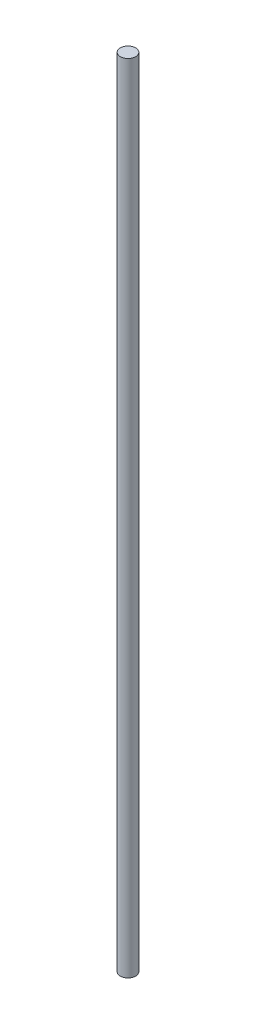
ISO-10303-21;
HEADER;
FILE_DESCRIPTION(('STEP AP214'),'2;1');
FILE_NAME('part.step','',(''),(''),'','','');
FILE_SCHEMA(('AUTOMOTIVE_DESIGN { 1 0 10303 214 1 1 1 1 }'));
ENDSEC;
DATA;
#1=APPLICATION_CONTEXT('core data for automotive mechanical design processes');
#2=APPLICATION_PROTOCOL_DEFINITION('international standard','automotive_design',2000,#1);
#3=PRODUCT_CONTEXT('',#1,'mechanical');
#4=PRODUCT('Part','Part','',(#3));
#5=PRODUCT_RELATED_PRODUCT_CATEGORY('part','',(#4));
#6=PRODUCT_DEFINITION_FORMATION('','',#4);
#7=PRODUCT_DEFINITION_CONTEXT('part definition',#1,'design');
#8=PRODUCT_DEFINITION('design','',#6,#7);
#9=PRODUCT_DEFINITION_SHAPE('','',#8);
#10=(LENGTH_UNIT() NAMED_UNIT(*) SI_UNIT(.MILLI.,.METRE.));
#11=(NAMED_UNIT(*) PLANE_ANGLE_UNIT() SI_UNIT($,.RADIAN.));
#12=(NAMED_UNIT(*) SI_UNIT($,.STERADIAN.) SOLID_ANGLE_UNIT());
#13=UNCERTAINTY_MEASURE_WITH_UNIT(LENGTH_MEASURE(1.E-05),#10,'distance_accuracy_value','');
#14=(GEOMETRIC_REPRESENTATION_CONTEXT(3) GLOBAL_UNCERTAINTY_ASSIGNED_CONTEXT((#13)) GLOBAL_UNIT_ASSIGNED_CONTEXT((#10,
#11,#12)) REPRESENTATION_CONTEXT('',''));
#15=CARTESIAN_POINT('',(0.,0.,0.));
#16=DIRECTION('',(0.,0.,1.));
#17=DIRECTION('',(1.,0.,0.));
#18=AXIS2_PLACEMENT_3D('',#15,#16,#17);
#19=CARTESIAN_POINT('',(0.,494.,0.));
#20=DIRECTION('',(0.,-1.,0.));
#21=DIRECTION('',(0.,0.,-1.));
#22=AXIS2_PLACEMENT_3D('',#19,#20,#21);
#23=CYLINDRICAL_SURFACE('',#22,4.75);
#24=CARTESIAN_POINT('',(0.,494.,0.));
#25=DIRECTION('',(0.,1.,0.));
#26=DIRECTION('',(0.,0.,1.));
#27=AXIS2_PLACEMENT_3D('',#24,#25,#26);
#28=CIRCLE('',#27,4.75);
#29=CARTESIAN_POINT('',(0.,494.,4.75));
#30=VERTEX_POINT('',#29);
#31=EDGE_CURVE('E10',#30,#30,#28,.T.);
#32=ORIENTED_EDGE('',*,*,#31,.F.);
#33=EDGE_LOOP('',(#32));
#34=FACE_BOUND('',#33,.T.);
#35=CARTESIAN_POINT('',(0.,0.,0.));
#36=DIRECTION('',(0.,1.,0.));
#37=DIRECTION('',(0.,0.,1.));
#38=AXIS2_PLACEMENT_3D('',#35,#36,#37);
#39=CIRCLE('',#38,4.75);
#40=CARTESIAN_POINT('',(0.,0.,4.75));
#41=VERTEX_POINT('',#40);
#42=EDGE_CURVE('E36',#41,#41,#39,.T.);
#43=ORIENTED_EDGE('',*,*,#42,.T.);
#44=EDGE_LOOP('',(#43));
#45=FACE_BOUND('',#44,.T.);
#46=ADVANCED_FACE('F33',(#34,#45),#23,.T.);
#47=CARTESIAN_POINT('',(0.,494.,0.));
#48=DIRECTION('',(0.,1.,0.));
#49=DIRECTION('',(0.,0.,1.));
#50=AXIS2_PLACEMENT_3D('',#47,#48,#49);
#51=PLANE('',#50);
#52=ORIENTED_EDGE('',*,*,#31,.T.);
#53=EDGE_LOOP('',(#52));
#54=FACE_BOUND('',#53,.T.);
#55=ADVANCED_FACE('F48',(#54),#51,.T.);
#56=CARTESIAN_POINT('',(0.,0.,0.));
#57=DIRECTION('',(0.,1.,0.));
#58=DIRECTION('',(0.,0.,1.));
#59=AXIS2_PLACEMENT_3D('',#56,#57,#58);
#60=PLANE('',#59);
#61=ORIENTED_EDGE('',*,*,#42,.F.);
#62=EDGE_LOOP('',(#61));
#63=FACE_BOUND('',#62,.T.);
#64=ADVANCED_FACE('F46',(#63),#60,.F.);
#65=CLOSED_SHELL('',(#46,#55,#64));
#66=MANIFOLD_SOLID_BREP('B2',#65);
#67=ADVANCED_BREP_SHAPE_REPRESENTATION('',(#18,#66),#14);
#68=SHAPE_DEFINITION_REPRESENTATION(#9,#67);
ENDSEC;
END-ISO-10303-21;
